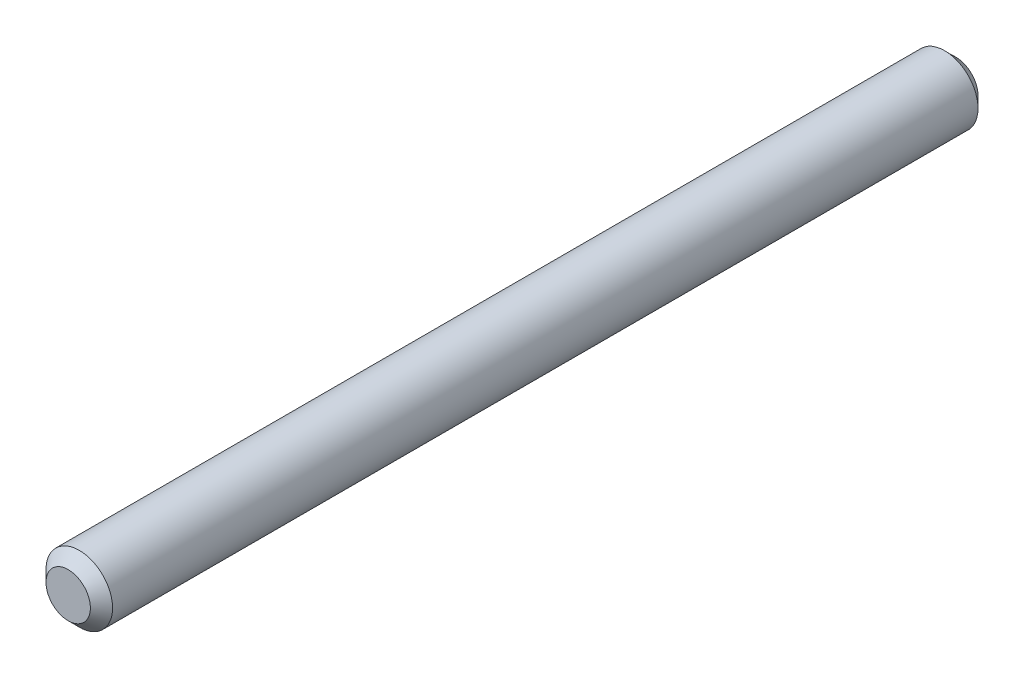
ISO-10303-21;
HEADER;
FILE_DESCRIPTION(('STEP AP214'),'2;1');
FILE_NAME('part.step','',(''),(''),'','','');
FILE_SCHEMA(('AUTOMOTIVE_DESIGN { 1 0 10303 214 1 1 1 1 }'));
ENDSEC;
DATA;
#1=APPLICATION_CONTEXT('core data for automotive mechanical design processes');
#2=APPLICATION_PROTOCOL_DEFINITION('international standard','automotive_design',2000,#1);
#3=PRODUCT_CONTEXT('',#1,'mechanical');
#4=PRODUCT('Part','Part','',(#3));
#5=PRODUCT_RELATED_PRODUCT_CATEGORY('part','',(#4));
#6=PRODUCT_DEFINITION_FORMATION('','',#4);
#7=PRODUCT_DEFINITION_CONTEXT('part definition',#1,'design');
#8=PRODUCT_DEFINITION('design','',#6,#7);
#9=PRODUCT_DEFINITION_SHAPE('','',#8);
#10=(LENGTH_UNIT() NAMED_UNIT(*) SI_UNIT(.MILLI.,.METRE.));
#11=(NAMED_UNIT(*) PLANE_ANGLE_UNIT() SI_UNIT($,.RADIAN.));
#12=(NAMED_UNIT(*) SI_UNIT($,.STERADIAN.) SOLID_ANGLE_UNIT());
#13=UNCERTAINTY_MEASURE_WITH_UNIT(LENGTH_MEASURE(1.E-05),#10,'distance_accuracy_value','');
#14=(GEOMETRIC_REPRESENTATION_CONTEXT(3) GLOBAL_UNCERTAINTY_ASSIGNED_CONTEXT((#13)) GLOBAL_UNIT_ASSIGNED_CONTEXT((#10,
#11,#12)) REPRESENTATION_CONTEXT('',''));
#15=CARTESIAN_POINT('',(0.,0.,0.));
#16=DIRECTION('',(0.,0.,1.));
#17=DIRECTION('',(1.,0.,0.));
#18=AXIS2_PLACEMENT_3D('',#15,#16,#17);
#19=CARTESIAN_POINT('',(0.,0.,20.));
#20=DIRECTION('',(0.,0.,-1.));
#21=DIRECTION('',(-1.,0.,0.));
#22=AXIS2_PLACEMENT_3D('',#19,#20,#21);
#23=CYLINDRICAL_SURFACE('',#22,1.5);
#24=CARTESIAN_POINT('',(0.,0.,-19.5));
#25=DIRECTION('',(0.,0.,1.));
#26=DIRECTION('',(1.,0.,0.));
#27=AXIS2_PLACEMENT_3D('',#24,#25,#26);
#28=CIRCLE('',#27,1.5);
#29=CARTESIAN_POINT('',(1.5,0.,-19.5));
#30=VERTEX_POINT('',#29);
#31=EDGE_CURVE('E41',#30,#30,#28,.T.);
#32=ORIENTED_EDGE('',*,*,#31,.T.);
#33=EDGE_LOOP('',(#32));
#34=FACE_BOUND('',#33,.T.);
#35=CARTESIAN_POINT('',(0.,0.,19.5));
#36=DIRECTION('',(0.,0.,1.));
#37=DIRECTION('',(1.,0.,0.));
#38=AXIS2_PLACEMENT_3D('',#35,#36,#37);
#39=CIRCLE('',#38,1.5);
#40=CARTESIAN_POINT('',(1.5,0.,19.5));
#41=VERTEX_POINT('',#40);
#42=EDGE_CURVE('E45',#41,#41,#39,.F.);
#43=ORIENTED_EDGE('',*,*,#42,.T.);
#44=EDGE_LOOP('',(#43));
#45=FACE_BOUND('',#44,.T.);
#46=ADVANCED_FACE('F30',(#34,#45),#23,.T.);
#47=CARTESIAN_POINT('',(0.,0.,20.));
#48=DIRECTION('',(0.,0.,1.));
#49=DIRECTION('',(1.,0.,0.));
#50=AXIS2_PLACEMENT_3D('',#47,#48,#49);
#51=PLANE('',#50);
#52=CARTESIAN_POINT('',(0.,0.,20.));
#53=DIRECTION('',(0.,0.,1.));
#54=DIRECTION('',(1.,0.,0.));
#55=AXIS2_PLACEMENT_3D('',#52,#53,#54);
#56=CIRCLE('',#55,0.999999999999997);
#57=CARTESIAN_POINT('',(0.999999999999997,0.,20.));
#58=VERTEX_POINT('',#57);
#59=EDGE_CURVE('E10',#58,#58,#56,.T.);
#60=ORIENTED_EDGE('',*,*,#59,.T.);
#61=EDGE_LOOP('',(#60));
#62=FACE_BOUND('',#61,.T.);
#63=ADVANCED_FACE('F61',(#62),#51,.T.);
#64=CARTESIAN_POINT('',(0.,0.,-20.));
#65=DIRECTION('',(0.,0.,1.));
#66=DIRECTION('',(1.,0.,0.));
#67=AXIS2_PLACEMENT_3D('',#64,#65,#66);
#68=PLANE('',#67);
#69=CARTESIAN_POINT('',(0.,0.,-20.));
#70=DIRECTION('',(0.,0.,1.));
#71=DIRECTION('',(1.,0.,0.));
#72=AXIS2_PLACEMENT_3D('',#69,#70,#71);
#73=CIRCLE('',#72,1.);
#74=CARTESIAN_POINT('',(1.,0.,-20.));
#75=VERTEX_POINT('',#74);
#76=EDGE_CURVE('E37',#75,#75,#73,.F.);
#77=ORIENTED_EDGE('',*,*,#76,.T.);
#78=EDGE_LOOP('',(#77));
#79=FACE_BOUND('',#78,.T.);
#80=ADVANCED_FACE('F58',(#79),#68,.F.);
#81=CARTESIAN_POINT('',(0.,0.,-19.5));
#82=DIRECTION('',(0.,0.,1.));
#83=DIRECTION('',(1.,0.,0.));
#84=AXIS2_PLACEMENT_3D('',#81,#82,#83);
#85=CONICAL_SURFACE('',#84,1.5,0.785398163397454);
#86=ORIENTED_EDGE('',*,*,#76,.F.);
#87=EDGE_LOOP('',(#86));
#88=FACE_BOUND('',#87,.T.);
#89=ORIENTED_EDGE('',*,*,#31,.F.);
#90=EDGE_LOOP('',(#89));
#91=FACE_BOUND('',#90,.T.);
#92=ADVANCED_FACE('F54',(#88,#91),#85,.T.);
#93=CARTESIAN_POINT('',(0.,0.,20.));
#94=DIRECTION('',(0.,0.,-1.));
#95=DIRECTION('',(-1.,0.,0.));
#96=AXIS2_PLACEMENT_3D('',#93,#94,#95);
#97=CONICAL_SURFACE('',#96,0.999999999999997,0.785398163397447);
#98=ORIENTED_EDGE('',*,*,#42,.F.);
#99=EDGE_LOOP('',(#98));
#100=FACE_BOUND('',#99,.T.);
#101=ORIENTED_EDGE('',*,*,#59,.F.);
#102=EDGE_LOOP('',(#101));
#103=FACE_BOUND('',#102,.T.);
#104=ADVANCED_FACE('F32',(#100,#103),#97,.T.);
#105=CLOSED_SHELL('',(#46,#63,#80,#92,#104));
#106=MANIFOLD_SOLID_BREP('B2',#105);
#107=ADVANCED_BREP_SHAPE_REPRESENTATION('',(#18,#106),#14);
#108=SHAPE_DEFINITION_REPRESENTATION(#9,#107);
ENDSEC;
END-ISO-10303-21;
